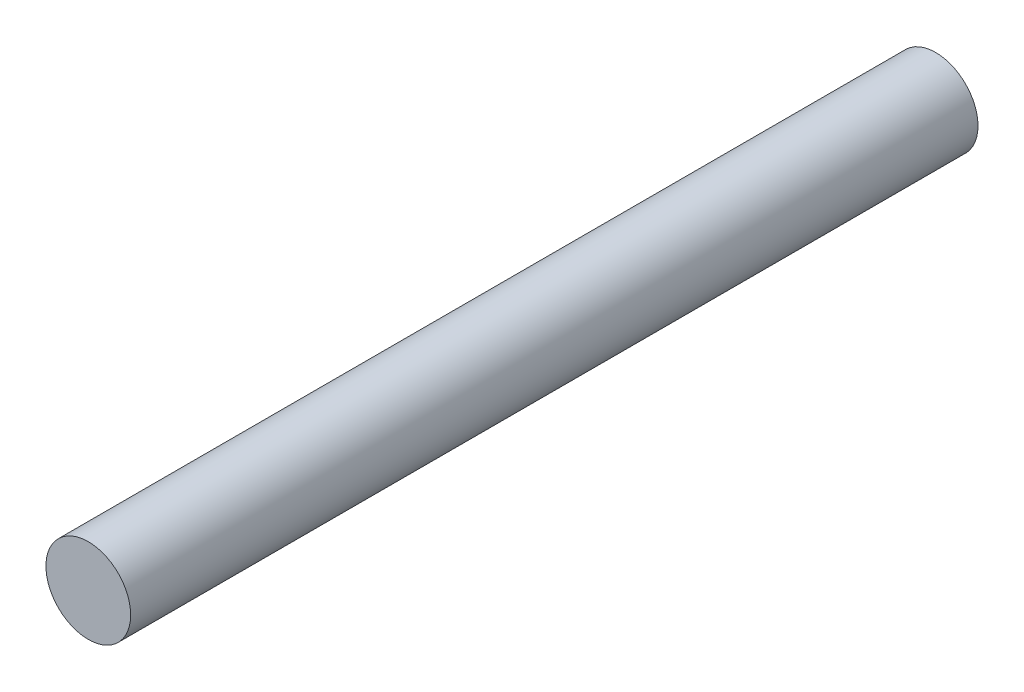
ISO-10303-21;
HEADER;
FILE_DESCRIPTION(('STEP AP214'),'2;1');
FILE_NAME('part.step','',(''),(''),'','','');
FILE_SCHEMA(('AUTOMOTIVE_DESIGN { 1 0 10303 214 1 1 1 1 }'));
ENDSEC;
DATA;
#1=APPLICATION_CONTEXT('core data for automotive mechanical design processes');
#2=APPLICATION_PROTOCOL_DEFINITION('international standard','automotive_design',2000,#1);
#3=PRODUCT_CONTEXT('',#1,'mechanical');
#4=PRODUCT('Part','Part','',(#3));
#5=PRODUCT_RELATED_PRODUCT_CATEGORY('part','',(#4));
#6=PRODUCT_DEFINITION_FORMATION('','',#4);
#7=PRODUCT_DEFINITION_CONTEXT('part definition',#1,'design');
#8=PRODUCT_DEFINITION('design','',#6,#7);
#9=PRODUCT_DEFINITION_SHAPE('','',#8);
#10=(LENGTH_UNIT() NAMED_UNIT(*) SI_UNIT(.MILLI.,.METRE.));
#11=(NAMED_UNIT(*) PLANE_ANGLE_UNIT() SI_UNIT($,.RADIAN.));
#12=(NAMED_UNIT(*) SI_UNIT($,.STERADIAN.) SOLID_ANGLE_UNIT());
#13=UNCERTAINTY_MEASURE_WITH_UNIT(LENGTH_MEASURE(1.E-05),#10,'distance_accuracy_value','');
#14=(GEOMETRIC_REPRESENTATION_CONTEXT(3) GLOBAL_UNCERTAINTY_ASSIGNED_CONTEXT((#13)) GLOBAL_UNIT_ASSIGNED_CONTEXT((#10,
#11,#12)) REPRESENTATION_CONTEXT('',''));
#15=CARTESIAN_POINT('',(0.,0.,0.));
#16=DIRECTION('',(0.,0.,1.));
#17=DIRECTION('',(1.,0.,0.));
#18=AXIS2_PLACEMENT_3D('',#15,#16,#17);
#19=CARTESIAN_POINT('',(0.,0.,30.));
#20=DIRECTION('',(0.,0.,-1.));
#21=DIRECTION('',(-1.,0.,0.));
#22=AXIS2_PLACEMENT_3D('',#19,#20,#21);
#23=CYLINDRICAL_SURFACE('',#22,1.5);
#24=CARTESIAN_POINT('',(0.,0.,30.));
#25=DIRECTION('',(0.,0.,1.));
#26=DIRECTION('',(1.,0.,0.));
#27=AXIS2_PLACEMENT_3D('',#24,#25,#26);
#28=CIRCLE('',#27,1.5);
#29=CARTESIAN_POINT('',(1.5,0.,30.));
#30=VERTEX_POINT('',#29);
#31=EDGE_CURVE('E10',#30,#30,#28,.T.);
#32=ORIENTED_EDGE('',*,*,#31,.F.);
#33=EDGE_LOOP('',(#32));
#34=FACE_BOUND('',#33,.T.);
#35=CARTESIAN_POINT('',(0.,0.,0.));
#36=DIRECTION('',(0.,0.,1.));
#37=DIRECTION('',(1.,0.,0.));
#38=AXIS2_PLACEMENT_3D('',#35,#36,#37);
#39=CIRCLE('',#38,1.5);
#40=CARTESIAN_POINT('',(1.5,0.,0.));
#41=VERTEX_POINT('',#40);
#42=EDGE_CURVE('E34',#41,#41,#39,.T.);
#43=ORIENTED_EDGE('',*,*,#42,.T.);
#44=EDGE_LOOP('',(#43));
#45=FACE_BOUND('',#44,.T.);
#46=ADVANCED_FACE('F31',(#34,#45),#23,.T.);
#47=CARTESIAN_POINT('',(0.,0.,30.));
#48=DIRECTION('',(0.,0.,1.));
#49=DIRECTION('',(1.,0.,0.));
#50=AXIS2_PLACEMENT_3D('',#47,#48,#49);
#51=PLANE('',#50);
#52=ORIENTED_EDGE('',*,*,#31,.T.);
#53=EDGE_LOOP('',(#52));
#54=FACE_BOUND('',#53,.T.);
#55=ADVANCED_FACE('F46',(#54),#51,.T.);
#56=CARTESIAN_POINT('',(0.,0.,0.));
#57=DIRECTION('',(0.,0.,1.));
#58=DIRECTION('',(1.,0.,0.));
#59=AXIS2_PLACEMENT_3D('',#56,#57,#58);
#60=PLANE('',#59);
#61=ORIENTED_EDGE('',*,*,#42,.F.);
#62=EDGE_LOOP('',(#61));
#63=FACE_BOUND('',#62,.T.);
#64=ADVANCED_FACE('F44',(#63),#60,.F.);
#65=CLOSED_SHELL('',(#46,#55,#64));
#66=MANIFOLD_SOLID_BREP('B2',#65);
#67=ADVANCED_BREP_SHAPE_REPRESENTATION('',(#18,#66),#14);
#68=SHAPE_DEFINITION_REPRESENTATION(#9,#67);
ENDSEC;
END-ISO-10303-21;
